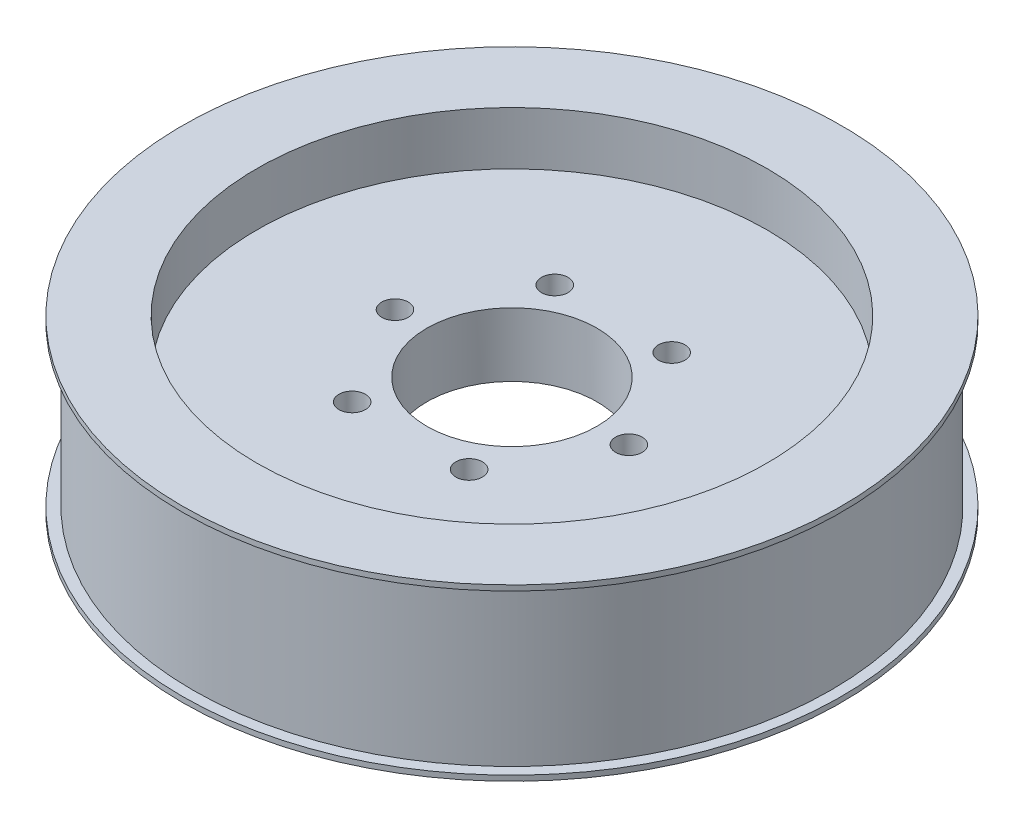
ISO-10303-21;
HEADER;
FILE_DESCRIPTION(('STEP AP214'),'2;1');
FILE_NAME('part.step','',(''),(''),'','','');
FILE_SCHEMA(('AUTOMOTIVE_DESIGN { 1 0 10303 214 1 1 1 1 }'));
ENDSEC;
DATA;
#1=APPLICATION_CONTEXT('core data for automotive mechanical design processes');
#2=APPLICATION_PROTOCOL_DEFINITION('international standard','automotive_design',2000,#1);
#3=PRODUCT_CONTEXT('',#1,'mechanical');
#4=PRODUCT('Part','Part','',(#3));
#5=PRODUCT_RELATED_PRODUCT_CATEGORY('part','',(#4));
#6=PRODUCT_DEFINITION_FORMATION('','',#4);
#7=PRODUCT_DEFINITION_CONTEXT('part definition',#1,'design');
#8=PRODUCT_DEFINITION('design','',#6,#7);
#9=PRODUCT_DEFINITION_SHAPE('','',#8);
#10=(LENGTH_UNIT() NAMED_UNIT(*) SI_UNIT(.MILLI.,.METRE.));
#11=(NAMED_UNIT(*) PLANE_ANGLE_UNIT() SI_UNIT($,.RADIAN.));
#12=(NAMED_UNIT(*) SI_UNIT($,.STERADIAN.) SOLID_ANGLE_UNIT());
#13=UNCERTAINTY_MEASURE_WITH_UNIT(LENGTH_MEASURE(1.E-05),#10,'distance_accuracy_value','');
#14=(GEOMETRIC_REPRESENTATION_CONTEXT(3) GLOBAL_UNCERTAINTY_ASSIGNED_CONTEXT((#13)) GLOBAL_UNIT_ASSIGNED_CONTEXT((#10,
#11,#12)) REPRESENTATION_CONTEXT('',''));
#15=CARTESIAN_POINT('',(0.,0.,0.));
#16=DIRECTION('',(0.,0.,1.));
#17=DIRECTION('',(1.,0.,0.));
#18=AXIS2_PLACEMENT_3D('',#15,#16,#17);
#19=CARTESIAN_POINT('',(0.,4.15086206896551,0.));
#20=DIRECTION('',(0.,1.,0.));
#21=DIRECTION('',(0.,0.,1.));
#22=AXIS2_PLACEMENT_3D('',#19,#20,#21);
#23=PLANE('',#22);
#24=CARTESIAN_POINT('',(5.50000000000011,4.15086206896551,-9.52627944162876));
#25=DIRECTION('',(0.,1.,0.));
#26=DIRECTION('',(0.,0.,1.));
#27=AXIS2_PLACEMENT_3D('',#24,#25,#26);
#28=CIRCLE('',#27,1.25);
#29=CARTESIAN_POINT('',(5.50000000000011,4.15086206896551,-8.27627944162876));
#30=VERTEX_POINT('',#29);
#31=EDGE_CURVE('E96',#30,#30,#28,.T.);
#32=ORIENTED_EDGE('',*,*,#31,.T.);
#33=EDGE_LOOP('',(#32));
#34=FACE_BOUND('',#33,.T.);
#35=CARTESIAN_POINT('',(-5.49999999999991,4.15086206896551,-9.52627944162887));
#36=DIRECTION('',(0.,1.,0.));
#37=DIRECTION('',(0.,0.,1.));
#38=AXIS2_PLACEMENT_3D('',#35,#36,#37);
#39=CIRCLE('',#38,1.25);
#40=CARTESIAN_POINT('',(-5.49999999999991,4.15086206896551,-8.27627944162887));
#41=VERTEX_POINT('',#40);
#42=EDGE_CURVE('E82',#41,#41,#39,.T.);
#43=ORIENTED_EDGE('',*,*,#42,.T.);
#44=EDGE_LOOP('',(#43));
#45=FACE_BOUND('',#44,.T.);
#46=CARTESIAN_POINT('',(-11.,4.15086206896551,0.));
#47=DIRECTION('',(0.,1.,0.));
#48=DIRECTION('',(0.,0.,1.));
#49=AXIS2_PLACEMENT_3D('',#46,#47,#48);
#50=CIRCLE('',#49,1.25);
#51=CARTESIAN_POINT('',(-11.,4.15086206896551,1.24999999999992));
#52=VERTEX_POINT('',#51);
#53=EDGE_CURVE('E78',#52,#52,#50,.T.);
#54=ORIENTED_EDGE('',*,*,#53,.T.);
#55=EDGE_LOOP('',(#54));
#56=FACE_BOUND('',#55,.T.);
#57=CARTESIAN_POINT('',(-5.50000000000005,4.15086206896551,9.5262794416288));
#58=DIRECTION('',(0.,1.,0.));
#59=DIRECTION('',(0.,0.,1.));
#60=AXIS2_PLACEMENT_3D('',#57,#58,#59);
#61=CIRCLE('',#60,1.25);
#62=CARTESIAN_POINT('',(-5.50000000000005,4.15086206896551,10.7762794416288));
#63=VERTEX_POINT('',#62);
#64=EDGE_CURVE('E74',#63,#63,#61,.T.);
#65=ORIENTED_EDGE('',*,*,#64,.T.);
#66=EDGE_LOOP('',(#65));
#67=FACE_BOUND('',#66,.T.);
#68=CARTESIAN_POINT('',(5.49999999999998,4.15086206896551,9.52627944162884));
#69=DIRECTION('',(0.,1.,0.));
#70=DIRECTION('',(0.,0.,1.));
#71=AXIS2_PLACEMENT_3D('',#68,#69,#70);
#72=CIRCLE('',#71,1.25);
#73=CARTESIAN_POINT('',(5.49999999999998,4.15086206896551,10.7762794416288));
#74=VERTEX_POINT('',#73);
#75=EDGE_CURVE('E69',#74,#74,#72,.T.);
#76=ORIENTED_EDGE('',*,*,#75,.T.);
#77=EDGE_LOOP('',(#76));
#78=FACE_BOUND('',#77,.T.);
#79=CARTESIAN_POINT('',(11.,4.15086206896551,0.));
#80=DIRECTION('',(0.,1.,0.));
#81=DIRECTION('',(0.,0.,1.));
#82=AXIS2_PLACEMENT_3D('',#79,#80,#81);
#83=CIRCLE('',#82,1.25);
#84=CARTESIAN_POINT('',(11.,4.15086206896551,1.25));
#85=VERTEX_POINT('',#84);
#86=EDGE_CURVE('E64',#85,#85,#83,.T.);
#87=ORIENTED_EDGE('',*,*,#86,.T.);
#88=EDGE_LOOP('',(#87));
#89=FACE_BOUND('',#88,.T.);
#90=CARTESIAN_POINT('',(0.,4.15086206896551,0.));
#91=DIRECTION('',(0.,1.,0.));
#92=DIRECTION('',(0.,0.,1.));
#93=AXIS2_PLACEMENT_3D('',#90,#91,#92);
#94=CIRCLE('',#93,8.);
#95=CARTESIAN_POINT('',(0.,4.15086206896551,8.));
#96=VERTEX_POINT('',#95);
#97=EDGE_CURVE('E59',#96,#96,#94,.T.);
#98=ORIENTED_EDGE('',*,*,#97,.T.);
#99=EDGE_LOOP('',(#98));
#100=FACE_BOUND('',#99,.T.);
#101=CARTESIAN_POINT('',(0.,4.15086206896551,0.));
#102=DIRECTION('',(0.,1.,0.));
#103=DIRECTION('',(0.,0.,1.));
#104=AXIS2_PLACEMENT_3D('',#101,#102,#103);
#105=CIRCLE('',#104,24.);
#106=CARTESIAN_POINT('',(0.,4.15086206896551,24.));
#107=VERTEX_POINT('',#106);
#108=EDGE_CURVE('E10',#107,#107,#105,.T.);
#109=ORIENTED_EDGE('',*,*,#108,.F.);
#110=EDGE_LOOP('',(#109));
#111=FACE_BOUND('',#110,.T.);
#112=ADVANCED_FACE('F37',(#34,#45,#56,#67,#78,#89,#100,#111),#23,.F.);
#113=CARTESIAN_POINT('',(0.,36.0129310344828,0.));
#114=DIRECTION('',(0.,1.,0.));
#115=DIRECTION('',(0.,0.,1.));
#116=AXIS2_PLACEMENT_3D('',#113,#114,#115);
#117=CYLINDRICAL_SURFACE('',#116,24.);
#118=CARTESIAN_POINT('',(0.,-0.849137931034485,0.));
#119=DIRECTION('',(0.,1.,0.));
#120=DIRECTION('',(0.,0.,1.));
#121=AXIS2_PLACEMENT_3D('',#118,#119,#120);
#122=CIRCLE('',#121,24.);
#123=CARTESIAN_POINT('',(0.,-0.849137931034485,24.));
#124=VERTEX_POINT('',#123);
#125=EDGE_CURVE('E45',#124,#124,#122,.T.);
#126=ORIENTED_EDGE('',*,*,#125,.F.);
#127=EDGE_LOOP('',(#126));
#128=FACE_BOUND('',#127,.T.);
#129=ORIENTED_EDGE('',*,*,#108,.T.);
#130=EDGE_LOOP('',(#129));
#131=FACE_BOUND('',#130,.T.);
#132=ADVANCED_FACE('F136',(#128,#131),#117,.F.);
#133=CARTESIAN_POINT('',(24.,-0.849137931034486,0.));
#134=DIRECTION('',(0.,1.,0.));
#135=DIRECTION('',(0.,0.,1.));
#136=AXIS2_PLACEMENT_3D('',#133,#134,#135);
#137=PLANE('',#136);
#138=CARTESIAN_POINT('',(0.,-0.849137931034485,0.));
#139=DIRECTION('',(0.,1.,0.));
#140=DIRECTION('',(0.,0.,1.));
#141=AXIS2_PLACEMENT_3D('',#138,#139,#140);
#142=CIRCLE('',#141,31.);
#143=CARTESIAN_POINT('',(0.,-0.849137931034485,31.));
#144=VERTEX_POINT('',#143);
#145=EDGE_CURVE('E51',#144,#144,#142,.T.);
#146=ORIENTED_EDGE('',*,*,#145,.F.);
#147=EDGE_LOOP('',(#146));
#148=FACE_BOUND('',#147,.T.);
#149=ORIENTED_EDGE('',*,*,#125,.T.);
#150=EDGE_LOOP('',(#149));
#151=FACE_BOUND('',#150,.T.);
#152=ADVANCED_FACE('F133',(#148,#151),#137,.F.);
#153=CARTESIAN_POINT('',(0.,36.0129310344828,0.));
#154=DIRECTION('',(0.,1.,0.));
#155=DIRECTION('',(0.,0.,1.));
#156=AXIS2_PLACEMENT_3D('',#153,#154,#155);
#157=CYLINDRICAL_SURFACE('',#156,31.);
#158=CARTESIAN_POINT('',(0.,-0.349137931034485,0.));
#159=DIRECTION('',(0.,1.,0.));
#160=DIRECTION('',(0.,0.,1.));
#161=AXIS2_PLACEMENT_3D('',#158,#159,#160);
#162=CIRCLE('',#161,31.);
#163=CARTESIAN_POINT('',(0.,-0.349137931034485,31.));
#164=VERTEX_POINT('',#163);
#165=EDGE_CURVE('E124',#164,#164,#162,.T.);
#166=ORIENTED_EDGE('',*,*,#165,.F.);
#167=EDGE_LOOP('',(#166));
#168=FACE_BOUND('',#167,.T.);
#169=ORIENTED_EDGE('',*,*,#145,.T.);
#170=EDGE_LOOP('',(#169));
#171=FACE_BOUND('',#170,.T.);
#172=ADVANCED_FACE('F131',(#168,#171),#157,.T.);
#173=CARTESIAN_POINT('',(31.,-0.349137931034485,0.));
#174=DIRECTION('',(0.,-1.,0.));
#175=DIRECTION('',(0.,0.,-1.));
#176=AXIS2_PLACEMENT_3D('',#173,#174,#175);
#177=PLANE('',#176);
#178=CARTESIAN_POINT('',(0.,-0.349137931034485,0.));
#179=DIRECTION('',(0.,1.,0.));
#180=DIRECTION('',(0.,0.,1.));
#181=AXIS2_PLACEMENT_3D('',#178,#179,#180);
#182=CIRCLE('',#181,30.);
#183=CARTESIAN_POINT('',(0.,-0.349137931034485,30.));
#184=VERTEX_POINT('',#183);
#185=EDGE_CURVE('E120',#184,#184,#182,.T.);
#186=ORIENTED_EDGE('',*,*,#185,.F.);
#187=EDGE_LOOP('',(#186));
#188=FACE_BOUND('',#187,.T.);
#189=ORIENTED_EDGE('',*,*,#165,.T.);
#190=EDGE_LOOP('',(#189));
#191=FACE_BOUND('',#190,.T.);
#192=ADVANCED_FACE('F148',(#188,#191),#177,.F.);
#193=CARTESIAN_POINT('',(0.,36.0129310344828,0.));
#194=DIRECTION('',(0.,1.,0.));
#195=DIRECTION('',(0.,0.,1.));
#196=AXIS2_PLACEMENT_3D('',#193,#194,#195);
#197=CYLINDRICAL_SURFACE('',#196,30.);
#198=CARTESIAN_POINT('',(0.,14.6508620689655,0.));
#199=DIRECTION('',(0.,1.,0.));
#200=DIRECTION('',(0.,0.,1.));
#201=AXIS2_PLACEMENT_3D('',#198,#199,#200);
#202=CIRCLE('',#201,30.);
#203=CARTESIAN_POINT('',(0.,14.6508620689655,30.));
#204=VERTEX_POINT('',#203);
#205=EDGE_CURVE('E116',#204,#204,#202,.T.);
#206=ORIENTED_EDGE('',*,*,#205,.F.);
#207=EDGE_LOOP('',(#206));
#208=FACE_BOUND('',#207,.T.);
#209=ORIENTED_EDGE('',*,*,#185,.T.);
#210=EDGE_LOOP('',(#209));
#211=FACE_BOUND('',#210,.T.);
#212=ADVANCED_FACE('F152',(#208,#211),#197,.T.);
#213=CARTESIAN_POINT('',(31.,14.6508620689655,0.));
#214=DIRECTION('',(0.,1.,0.));
#215=DIRECTION('',(0.,0.,1.));
#216=AXIS2_PLACEMENT_3D('',#213,#214,#215);
#217=PLANE('',#216);
#218=CARTESIAN_POINT('',(0.,14.6508620689655,0.));
#219=DIRECTION('',(0.,1.,0.));
#220=DIRECTION('',(0.,0.,1.));
#221=AXIS2_PLACEMENT_3D('',#218,#219,#220);
#222=CIRCLE('',#221,31.);
#223=CARTESIAN_POINT('',(0.,14.6508620689655,31.));
#224=VERTEX_POINT('',#223);
#225=EDGE_CURVE('E112',#224,#224,#222,.T.);
#226=ORIENTED_EDGE('',*,*,#225,.F.);
#227=EDGE_LOOP('',(#226));
#228=FACE_BOUND('',#227,.T.);
#229=ORIENTED_EDGE('',*,*,#205,.T.);
#230=EDGE_LOOP('',(#229));
#231=FACE_BOUND('',#230,.T.);
#232=ADVANCED_FACE('F156',(#228,#231),#217,.F.);
#233=CARTESIAN_POINT('',(0.,36.0129310344828,0.));
#234=DIRECTION('',(0.,1.,0.));
#235=DIRECTION('',(0.,0.,1.));
#236=AXIS2_PLACEMENT_3D('',#233,#234,#235);
#237=CYLINDRICAL_SURFACE('',#236,31.);
#238=CARTESIAN_POINT('',(0.,15.1508620689655,0.));
#239=DIRECTION('',(0.,1.,0.));
#240=DIRECTION('',(0.,0.,1.));
#241=AXIS2_PLACEMENT_3D('',#238,#239,#240);
#242=CIRCLE('',#241,31.);
#243=CARTESIAN_POINT('',(0.,15.1508620689655,31.));
#244=VERTEX_POINT('',#243);
#245=EDGE_CURVE('E108',#244,#244,#242,.T.);
#246=ORIENTED_EDGE('',*,*,#245,.F.);
#247=EDGE_LOOP('',(#246));
#248=FACE_BOUND('',#247,.T.);
#249=ORIENTED_EDGE('',*,*,#225,.T.);
#250=EDGE_LOOP('',(#249));
#251=FACE_BOUND('',#250,.T.);
#252=ADVANCED_FACE('F160',(#248,#251),#237,.T.);
#253=CARTESIAN_POINT('',(24.,15.1508620689655,0.));
#254=DIRECTION('',(0.,-1.,0.));
#255=DIRECTION('',(0.,0.,-1.));
#256=AXIS2_PLACEMENT_3D('',#253,#254,#255);
#257=PLANE('',#256);
#258=CARTESIAN_POINT('',(0.,15.1508620689655,0.));
#259=DIRECTION('',(0.,1.,0.));
#260=DIRECTION('',(0.,0.,1.));
#261=AXIS2_PLACEMENT_3D('',#258,#259,#260);
#262=CIRCLE('',#261,24.);
#263=CARTESIAN_POINT('',(0.,15.1508620689655,24.));
#264=VERTEX_POINT('',#263);
#265=EDGE_CURVE('E104',#264,#264,#262,.T.);
#266=ORIENTED_EDGE('',*,*,#265,.F.);
#267=EDGE_LOOP('',(#266));
#268=FACE_BOUND('',#267,.T.);
#269=ORIENTED_EDGE('',*,*,#245,.T.);
#270=EDGE_LOOP('',(#269));
#271=FACE_BOUND('',#270,.T.);
#272=ADVANCED_FACE('F164',(#268,#271),#257,.F.);
#273=CARTESIAN_POINT('',(0.,36.0129310344828,0.));
#274=DIRECTION('',(0.,1.,0.));
#275=DIRECTION('',(0.,0.,1.));
#276=AXIS2_PLACEMENT_3D('',#273,#274,#275);
#277=CYLINDRICAL_SURFACE('',#276,24.);
#278=CARTESIAN_POINT('',(0.,10.1508620689655,0.));
#279=DIRECTION('',(0.,1.,0.));
#280=DIRECTION('',(0.,0.,1.));
#281=AXIS2_PLACEMENT_3D('',#278,#279,#280);
#282=CIRCLE('',#281,24.);
#283=CARTESIAN_POINT('',(0.,10.1508620689655,24.));
#284=VERTEX_POINT('',#283);
#285=EDGE_CURVE('E100',#284,#284,#282,.T.);
#286=ORIENTED_EDGE('',*,*,#285,.F.);
#287=EDGE_LOOP('',(#286));
#288=FACE_BOUND('',#287,.T.);
#289=ORIENTED_EDGE('',*,*,#265,.T.);
#290=EDGE_LOOP('',(#289));
#291=FACE_BOUND('',#290,.T.);
#292=ADVANCED_FACE('F168',(#288,#291),#277,.F.);
#293=CARTESIAN_POINT('',(0.,10.1508620689655,0.));
#294=DIRECTION('',(0.,-1.,0.));
#295=DIRECTION('',(0.,0.,-1.));
#296=AXIS2_PLACEMENT_3D('',#293,#294,#295);
#297=PLANE('',#296);
#298=CARTESIAN_POINT('',(5.50000000000011,10.1508620689655,-9.52627944162876));
#299=DIRECTION('',(0.,-1.,0.));
#300=DIRECTION('',(0.,0.,-1.));
#301=AXIS2_PLACEMENT_3D('',#298,#299,#300);
#302=CIRCLE('',#301,1.25);
#303=CARTESIAN_POINT('',(5.50000000000011,10.1508620689655,-10.7762794416288));
#304=VERTEX_POINT('',#303);
#305=EDGE_CURVE('E40',#304,#304,#302,.T.);
#306=ORIENTED_EDGE('',*,*,#305,.T.);
#307=EDGE_LOOP('',(#306));
#308=FACE_BOUND('',#307,.T.);
#309=CARTESIAN_POINT('',(-5.49999999999991,10.1508620689655,-9.52627944162887));
#310=DIRECTION('',(0.,-1.,0.));
#311=DIRECTION('',(0.,0.,-1.));
#312=AXIS2_PLACEMENT_3D('',#309,#310,#311);
#313=CIRCLE('',#312,1.25);
#314=CARTESIAN_POINT('',(-5.49999999999991,10.1508620689655,-10.7762794416289));
#315=VERTEX_POINT('',#314);
#316=EDGE_CURVE('E79',#315,#315,#313,.T.);
#317=ORIENTED_EDGE('',*,*,#316,.T.);
#318=EDGE_LOOP('',(#317));
#319=FACE_BOUND('',#318,.T.);
#320=CARTESIAN_POINT('',(-11.,10.1508620689655,0.));
#321=DIRECTION('',(0.,-1.,0.));
#322=DIRECTION('',(0.,0.,-1.));
#323=AXIS2_PLACEMENT_3D('',#320,#321,#322);
#324=CIRCLE('',#323,1.25);
#325=CARTESIAN_POINT('',(-11.,10.1508620689655,-1.25000000000008));
#326=VERTEX_POINT('',#325);
#327=EDGE_CURVE('E75',#326,#326,#324,.T.);
#328=ORIENTED_EDGE('',*,*,#327,.T.);
#329=EDGE_LOOP('',(#328));
#330=FACE_BOUND('',#329,.T.);
#331=CARTESIAN_POINT('',(-5.50000000000005,10.1508620689655,9.5262794416288));
#332=DIRECTION('',(0.,-1.,0.));
#333=DIRECTION('',(0.,0.,-1.));
#334=AXIS2_PLACEMENT_3D('',#331,#332,#333);
#335=CIRCLE('',#334,1.25);
#336=CARTESIAN_POINT('',(-5.50000000000005,10.1508620689655,8.2762794416288));
#337=VERTEX_POINT('',#336);
#338=EDGE_CURVE('E70',#337,#337,#335,.T.);
#339=ORIENTED_EDGE('',*,*,#338,.T.);
#340=EDGE_LOOP('',(#339));
#341=FACE_BOUND('',#340,.T.);
#342=CARTESIAN_POINT('',(5.49999999999998,10.1508620689655,9.52627944162884));
#343=DIRECTION('',(0.,-1.,0.));
#344=DIRECTION('',(0.,0.,-1.));
#345=AXIS2_PLACEMENT_3D('',#342,#343,#344);
#346=CIRCLE('',#345,1.25);
#347=CARTESIAN_POINT('',(5.49999999999998,10.1508620689655,8.27627944162884));
#348=VERTEX_POINT('',#347);
#349=EDGE_CURVE('E65',#348,#348,#346,.T.);
#350=ORIENTED_EDGE('',*,*,#349,.T.);
#351=EDGE_LOOP('',(#350));
#352=FACE_BOUND('',#351,.T.);
#353=CARTESIAN_POINT('',(11.,10.1508620689655,0.));
#354=DIRECTION('',(0.,-1.,0.));
#355=DIRECTION('',(0.,0.,-1.));
#356=AXIS2_PLACEMENT_3D('',#353,#354,#355);
#357=CIRCLE('',#356,1.25);
#358=CARTESIAN_POINT('',(11.,10.1508620689655,-1.25));
#359=VERTEX_POINT('',#358);
#360=EDGE_CURVE('E60',#359,#359,#357,.T.);
#361=ORIENTED_EDGE('',*,*,#360,.T.);
#362=EDGE_LOOP('',(#361));
#363=FACE_BOUND('',#362,.T.);
#364=CARTESIAN_POINT('',(0.,10.1508620689655,0.));
#365=DIRECTION('',(0.,-1.,0.));
#366=DIRECTION('',(0.,0.,-1.));
#367=AXIS2_PLACEMENT_3D('',#364,#365,#366);
#368=CIRCLE('',#367,8.);
#369=CARTESIAN_POINT('',(0.,10.1508620689655,-8.));
#370=VERTEX_POINT('',#369);
#371=EDGE_CURVE('E55',#370,#370,#368,.T.);
#372=ORIENTED_EDGE('',*,*,#371,.T.);
#373=EDGE_LOOP('',(#372));
#374=FACE_BOUND('',#373,.T.);
#375=ORIENTED_EDGE('',*,*,#285,.T.);
#376=EDGE_LOOP('',(#375));
#377=FACE_BOUND('',#376,.T.);
#378=ADVANCED_FACE('F172',(#308,#319,#330,#341,#352,#363,#374,#377),#297,.F.);
#379=CARTESIAN_POINT('',(0.,-4.84913793103449,0.));
#380=DIRECTION('',(0.,1.,0.));
#381=DIRECTION('',(0.,0.,1.));
#382=AXIS2_PLACEMENT_3D('',#379,#380,#381);
#383=CYLINDRICAL_SURFACE('',#382,8.);
#384=ORIENTED_EDGE('',*,*,#371,.F.);
#385=EDGE_LOOP('',(#384));
#386=FACE_BOUND('',#385,.T.);
#387=ORIENTED_EDGE('',*,*,#97,.F.);
#388=EDGE_LOOP('',(#387));
#389=FACE_BOUND('',#388,.T.);
#390=ADVANCED_FACE('F176',(#386,#389),#383,.F.);
#391=CARTESIAN_POINT('',(11.,-4.84913793103449,0.));
#392=DIRECTION('',(0.,1.,0.));
#393=DIRECTION('',(0.,0.,1.));
#394=AXIS2_PLACEMENT_3D('',#391,#392,#393);
#395=CYLINDRICAL_SURFACE('',#394,1.25);
#396=ORIENTED_EDGE('',*,*,#360,.F.);
#397=EDGE_LOOP('',(#396));
#398=FACE_BOUND('',#397,.T.);
#399=ORIENTED_EDGE('',*,*,#86,.F.);
#400=EDGE_LOOP('',(#399));
#401=FACE_BOUND('',#400,.T.);
#402=ADVANCED_FACE('F180',(#398,#401),#395,.F.);
#403=CARTESIAN_POINT('',(5.49999999999998,-4.84913793103449,9.52627944162884));
#404=DIRECTION('',(0.,1.,0.));
#405=DIRECTION('',(0.,0.,1.));
#406=AXIS2_PLACEMENT_3D('',#403,#404,#405);
#407=CYLINDRICAL_SURFACE('',#406,1.25);
#408=ORIENTED_EDGE('',*,*,#349,.F.);
#409=EDGE_LOOP('',(#408));
#410=FACE_BOUND('',#409,.T.);
#411=ORIENTED_EDGE('',*,*,#75,.F.);
#412=EDGE_LOOP('',(#411));
#413=FACE_BOUND('',#412,.T.);
#414=ADVANCED_FACE('F197',(#410,#413),#407,.F.);
#415=CARTESIAN_POINT('',(-5.50000000000005,-4.84913793103449,9.5262794416288));
#416=DIRECTION('',(0.,1.,0.));
#417=DIRECTION('',(0.,0.,1.));
#418=AXIS2_PLACEMENT_3D('',#415,#416,#417);
#419=CYLINDRICAL_SURFACE('',#418,1.25);
#420=ORIENTED_EDGE('',*,*,#338,.F.);
#421=EDGE_LOOP('',(#420));
#422=FACE_BOUND('',#421,.T.);
#423=ORIENTED_EDGE('',*,*,#64,.F.);
#424=EDGE_LOOP('',(#423));
#425=FACE_BOUND('',#424,.T.);
#426=ADVANCED_FACE('F193',(#422,#425),#419,.F.);
#427=CARTESIAN_POINT('',(-11.,-4.84913793103449,0.));
#428=DIRECTION('',(0.,1.,0.));
#429=DIRECTION('',(0.,0.,1.));
#430=AXIS2_PLACEMENT_3D('',#427,#428,#429);
#431=CYLINDRICAL_SURFACE('',#430,1.25);
#432=ORIENTED_EDGE('',*,*,#327,.F.);
#433=EDGE_LOOP('',(#432));
#434=FACE_BOUND('',#433,.T.);
#435=ORIENTED_EDGE('',*,*,#53,.F.);
#436=EDGE_LOOP('',(#435));
#437=FACE_BOUND('',#436,.T.);
#438=ADVANCED_FACE('F189',(#434,#437),#431,.F.);
#439=CARTESIAN_POINT('',(-5.49999999999991,-4.84913793103449,-9.52627944162887));
#440=DIRECTION('',(0.,1.,0.));
#441=DIRECTION('',(0.,0.,1.));
#442=AXIS2_PLACEMENT_3D('',#439,#440,#441);
#443=CYLINDRICAL_SURFACE('',#442,1.25);
#444=ORIENTED_EDGE('',*,*,#316,.F.);
#445=EDGE_LOOP('',(#444));
#446=FACE_BOUND('',#445,.T.);
#447=ORIENTED_EDGE('',*,*,#42,.F.);
#448=EDGE_LOOP('',(#447));
#449=FACE_BOUND('',#448,.T.);
#450=ADVANCED_FACE('F185',(#446,#449),#443,.F.);
#451=CARTESIAN_POINT('',(5.50000000000011,-4.84913793103449,-9.52627944162876));
#452=DIRECTION('',(0.,1.,0.));
#453=DIRECTION('',(0.,0.,1.));
#454=AXIS2_PLACEMENT_3D('',#451,#452,#453);
#455=CYLINDRICAL_SURFACE('',#454,1.25);
#456=ORIENTED_EDGE('',*,*,#305,.F.);
#457=EDGE_LOOP('',(#456));
#458=FACE_BOUND('',#457,.T.);
#459=ORIENTED_EDGE('',*,*,#31,.F.);
#460=EDGE_LOOP('',(#459));
#461=FACE_BOUND('',#460,.T.);
#462=ADVANCED_FACE('F182',(#458,#461),#455,.F.);
#463=CLOSED_SHELL('',(#112,#132,#152,#172,#192,#212,#232,#252,#272,#292,#378,#390,#402,#414,
#426,#438,#450,#462));
#464=MANIFOLD_SOLID_BREP('B2',#463);
#465=ADVANCED_BREP_SHAPE_REPRESENTATION('',(#18,#464),#14);
#466=SHAPE_DEFINITION_REPRESENTATION(#9,#465);
ENDSEC;
END-ISO-10303-21;
